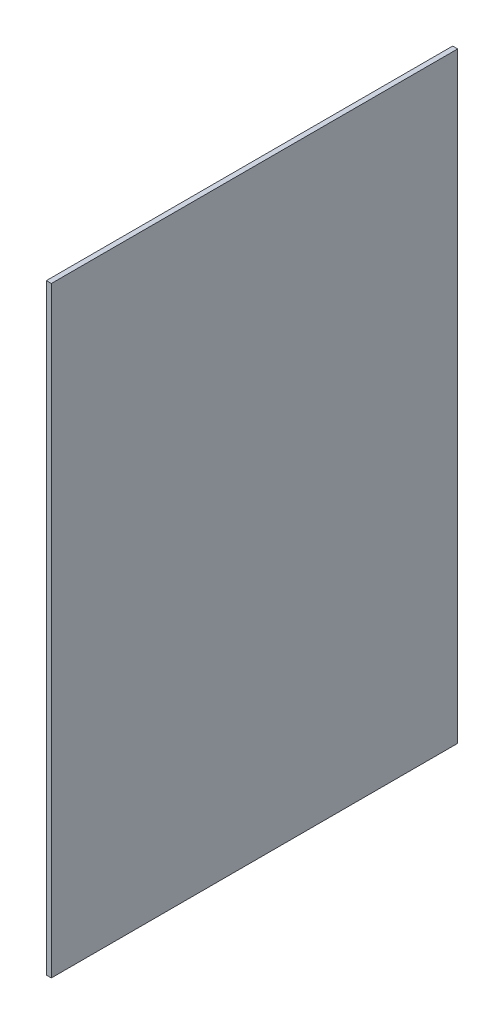
ISO-10303-21;
HEADER;
FILE_DESCRIPTION(('STEP AP214'),'2;1');
FILE_NAME('part.step','',(''),(''),'','','');
FILE_SCHEMA(('AUTOMOTIVE_DESIGN { 1 0 10303 214 1 1 1 1 }'));
ENDSEC;
DATA;
#1=APPLICATION_CONTEXT('core data for automotive mechanical design processes');
#2=APPLICATION_PROTOCOL_DEFINITION('international standard','automotive_design',2000,#1);
#3=PRODUCT_CONTEXT('',#1,'mechanical');
#4=PRODUCT('Part','Part','',(#3));
#5=PRODUCT_RELATED_PRODUCT_CATEGORY('part','',(#4));
#6=PRODUCT_DEFINITION_FORMATION('','',#4);
#7=PRODUCT_DEFINITION_CONTEXT('part definition',#1,'design');
#8=PRODUCT_DEFINITION('design','',#6,#7);
#9=PRODUCT_DEFINITION_SHAPE('','',#8);
#10=(LENGTH_UNIT() NAMED_UNIT(*) SI_UNIT(.MILLI.,.METRE.));
#11=(NAMED_UNIT(*) PLANE_ANGLE_UNIT() SI_UNIT($,.RADIAN.));
#12=(NAMED_UNIT(*) SI_UNIT($,.STERADIAN.) SOLID_ANGLE_UNIT());
#13=UNCERTAINTY_MEASURE_WITH_UNIT(LENGTH_MEASURE(1.E-05),#10,'distance_accuracy_value','');
#14=(GEOMETRIC_REPRESENTATION_CONTEXT(3) GLOBAL_UNCERTAINTY_ASSIGNED_CONTEXT((#13)) GLOBAL_UNIT_ASSIGNED_CONTEXT((#10,
#11,#12)) REPRESENTATION_CONTEXT('',''));
#15=CARTESIAN_POINT('',(0.,0.,0.));
#16=DIRECTION('',(0.,0.,1.));
#17=DIRECTION('',(1.,0.,0.));
#18=AXIS2_PLACEMENT_3D('',#15,#16,#17);
#19=CARTESIAN_POINT('',(3.9,-22.1688494861979,42.930152973272));
#20=DIRECTION('',(0.,1.,0.));
#21=DIRECTION('',(0.,0.,1.));
#22=AXIS2_PLACEMENT_3D('',#19,#20,#21);
#23=PLANE('',#22);
#24=DIRECTION('',(0.,0.,-1.));
#25=VECTOR('',#24,1.);
#26=CARTESIAN_POINT('',(0.,-22.1688494861979,42.930152973272));
#27=LINE('',#26,#25);
#28=CARTESIAN_POINT('',(0.,-22.1688494861979,42.930152973272));
#29=VERTEX_POINT('',#28);
#30=CARTESIAN_POINT('',(0.,-22.1688494861979,-274.569847026728));
#31=VERTEX_POINT('',#30);
#32=EDGE_CURVE('E95',#29,#31,#27,.T.);
#33=ORIENTED_EDGE('',*,*,#32,.T.);
#34=DIRECTION('',(-1.,0.,0.));
#35=VECTOR('',#34,1.);
#36=CARTESIAN_POINT('',(3.9,-22.1688494861979,-274.569847026728));
#37=LINE('',#36,#35);
#38=CARTESIAN_POINT('',(3.9,-22.1688494861979,-274.569847026728));
#39=VERTEX_POINT('',#38);
#40=EDGE_CURVE('E11',#39,#31,#37,.T.);
#41=ORIENTED_EDGE('',*,*,#40,.F.);
#42=DIRECTION('',(0.,0.,-1.));
#43=VECTOR('',#42,1.);
#44=CARTESIAN_POINT('',(3.9,-22.1688494861979,42.930152973272));
#45=LINE('',#44,#43);
#46=CARTESIAN_POINT('',(3.9,-22.1688494861979,42.930152973272));
#47=VERTEX_POINT('',#46);
#48=EDGE_CURVE('E72',#47,#39,#45,.T.);
#49=ORIENTED_EDGE('',*,*,#48,.F.);
#50=DIRECTION('',(-1.,0.,0.));
#51=VECTOR('',#50,1.);
#52=CARTESIAN_POINT('',(3.9,-22.1688494861979,42.930152973272));
#53=LINE('',#52,#51);
#54=EDGE_CURVE('E91',#47,#29,#53,.T.);
#55=ORIENTED_EDGE('',*,*,#54,.T.);
#56=EDGE_LOOP('',(#33,#41,#49,#55));
#57=FACE_BOUND('',#56,.T.);
#58=ADVANCED_FACE('F33',(#57),#23,.F.);
#59=CARTESIAN_POINT('',(3.9,447.731150513802,-274.569847026728));
#60=DIRECTION('',(0.,0.,-1.));
#61=DIRECTION('',(0.,1.,0.));
#62=AXIS2_PLACEMENT_3D('',#59,#60,#61);
#63=PLANE('',#62);
#64=DIRECTION('',(0.,-1.,0.));
#65=VECTOR('',#64,1.);
#66=CARTESIAN_POINT('',(0.,447.731150513802,-274.569847026728));
#67=LINE('',#66,#65);
#68=CARTESIAN_POINT('',(0.,447.731150513802,-274.569847026728));
#69=VERTEX_POINT('',#68);
#70=EDGE_CURVE('E81',#69,#31,#67,.T.);
#71=ORIENTED_EDGE('',*,*,#70,.F.);
#72=DIRECTION('',(-1.,0.,0.));
#73=VECTOR('',#72,1.);
#74=CARTESIAN_POINT('',(3.9,447.731150513802,-274.569847026728));
#75=LINE('',#74,#73);
#76=CARTESIAN_POINT('',(3.9,447.731150513802,-274.569847026728));
#77=VERTEX_POINT('',#76);
#78=EDGE_CURVE('E41',#77,#69,#75,.T.);
#79=ORIENTED_EDGE('',*,*,#78,.F.);
#80=DIRECTION('',(0.,-1.,0.));
#81=VECTOR('',#80,1.);
#82=CARTESIAN_POINT('',(3.9,447.731150513802,-274.569847026728));
#83=LINE('',#82,#81);
#84=EDGE_CURVE('E79',#77,#39,#83,.T.);
#85=ORIENTED_EDGE('',*,*,#84,.T.);
#86=ORIENTED_EDGE('',*,*,#40,.T.);
#87=EDGE_LOOP('',(#71,#79,#85,#86));
#88=FACE_BOUND('',#87,.T.);
#89=ADVANCED_FACE('F78',(#88),#63,.T.);
#90=CARTESIAN_POINT('',(3.9,447.731150513802,42.9301529732721));
#91=DIRECTION('',(0.,1.,0.));
#92=DIRECTION('',(0.,0.,1.));
#93=AXIS2_PLACEMENT_3D('',#90,#91,#92);
#94=PLANE('',#93);
#95=DIRECTION('',(0.,0.,-1.));
#96=VECTOR('',#95,1.);
#97=CARTESIAN_POINT('',(0.,447.731150513802,42.9301529732721));
#98=LINE('',#97,#96);
#99=CARTESIAN_POINT('',(0.,447.731150513802,42.9301529732721));
#100=VERTEX_POINT('',#99);
#101=EDGE_CURVE('E99',#100,#69,#98,.T.);
#102=ORIENTED_EDGE('',*,*,#101,.F.);
#103=DIRECTION('',(-1.,0.,0.));
#104=VECTOR('',#103,1.);
#105=CARTESIAN_POINT('',(3.9,447.731150513802,42.9301529732721));
#106=LINE('',#105,#104);
#107=CARTESIAN_POINT('',(3.9,447.731150513802,42.9301529732721));
#108=VERTEX_POINT('',#107);
#109=EDGE_CURVE('E64',#108,#100,#106,.T.);
#110=ORIENTED_EDGE('',*,*,#109,.F.);
#111=DIRECTION('',(0.,0.,-1.));
#112=VECTOR('',#111,1.);
#113=CARTESIAN_POINT('',(3.9,447.731150513802,42.9301529732721));
#114=LINE('',#113,#112);
#115=EDGE_CURVE('E87',#108,#77,#114,.T.);
#116=ORIENTED_EDGE('',*,*,#115,.T.);
#117=ORIENTED_EDGE('',*,*,#78,.T.);
#118=EDGE_LOOP('',(#102,#110,#116,#117));
#119=FACE_BOUND('',#118,.T.);
#120=ADVANCED_FACE('F89',(#119),#94,.T.);
#121=CARTESIAN_POINT('',(3.9,447.731150513802,42.9301529732721));
#122=DIRECTION('',(0.,0.,-1.));
#123=DIRECTION('',(0.,1.,0.));
#124=AXIS2_PLACEMENT_3D('',#121,#122,#123);
#125=PLANE('',#124);
#126=DIRECTION('',(0.,-1.,0.));
#127=VECTOR('',#126,1.);
#128=CARTESIAN_POINT('',(0.,447.731150513802,42.9301529732721));
#129=LINE('',#128,#127);
#130=EDGE_CURVE('E67',#100,#29,#129,.T.);
#131=ORIENTED_EDGE('',*,*,#130,.T.);
#132=ORIENTED_EDGE('',*,*,#54,.F.);
#133=DIRECTION('',(0.,-1.,0.));
#134=VECTOR('',#133,1.);
#135=CARTESIAN_POINT('',(3.9,447.731150513802,42.9301529732721));
#136=LINE('',#135,#134);
#137=EDGE_CURVE('E49',#108,#47,#136,.T.);
#138=ORIENTED_EDGE('',*,*,#137,.F.);
#139=ORIENTED_EDGE('',*,*,#109,.T.);
#140=EDGE_LOOP('',(#131,#132,#138,#139));
#141=FACE_BOUND('',#140,.T.);
#142=ADVANCED_FACE('F112',(#141),#125,.F.);
#143=CARTESIAN_POINT('',(3.9,0.,0.));
#144=DIRECTION('',(-1.,0.,0.));
#145=DIRECTION('',(0.,0.,1.));
#146=AXIS2_PLACEMENT_3D('',#143,#144,#145);
#147=PLANE('',#146);
#148=ORIENTED_EDGE('',*,*,#48,.T.);
#149=ORIENTED_EDGE('',*,*,#84,.F.);
#150=ORIENTED_EDGE('',*,*,#115,.F.);
#151=ORIENTED_EDGE('',*,*,#137,.T.);
#152=EDGE_LOOP('',(#148,#149,#150,#151));
#153=FACE_BOUND('',#152,.T.);
#154=ADVANCED_FACE('F86',(#153),#147,.F.);
#155=CARTESIAN_POINT('',(0.,0.,0.));
#156=DIRECTION('',(-1.,0.,0.));
#157=DIRECTION('',(0.,0.,1.));
#158=AXIS2_PLACEMENT_3D('',#155,#156,#157);
#159=PLANE('',#158);
#160=ORIENTED_EDGE('',*,*,#32,.F.);
#161=ORIENTED_EDGE('',*,*,#130,.F.);
#162=ORIENTED_EDGE('',*,*,#101,.T.);
#163=ORIENTED_EDGE('',*,*,#70,.T.);
#164=EDGE_LOOP('',(#160,#161,#162,#163));
#165=FACE_BOUND('',#164,.T.);
#166=ADVANCED_FACE('F106',(#165),#159,.T.);
#167=CLOSED_SHELL('',(#58,#89,#120,#142,#154,#166));
#168=MANIFOLD_SOLID_BREP('B2',#167);
#169=ADVANCED_BREP_SHAPE_REPRESENTATION('',(#18,#168),#14);
#170=SHAPE_DEFINITION_REPRESENTATION(#9,#169);
ENDSEC;
END-ISO-10303-21;
